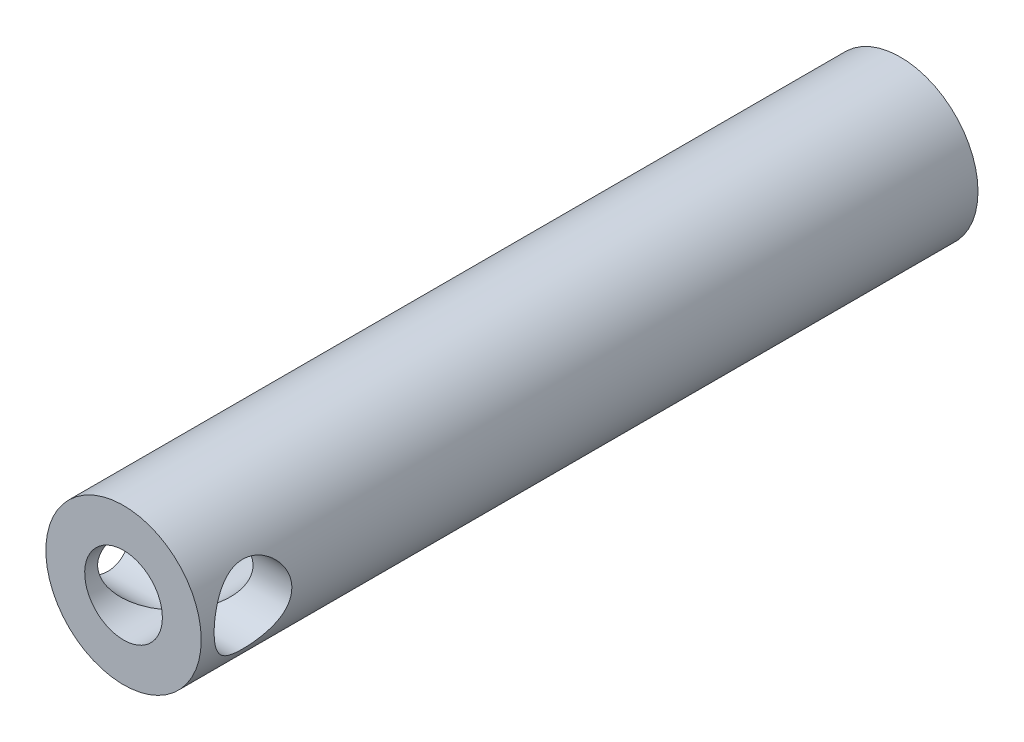
ISO-10303-21;
HEADER;
FILE_DESCRIPTION(('STEP AP214'),'2;1');
FILE_NAME('part.step','',(''),(''),'','','');
FILE_SCHEMA(('AUTOMOTIVE_DESIGN { 1 0 10303 214 1 1 1 1 }'));
ENDSEC;
DATA;
#1=APPLICATION_CONTEXT('core data for automotive mechanical design processes');
#2=APPLICATION_PROTOCOL_DEFINITION('international standard','automotive_design',2000,#1);
#3=PRODUCT_CONTEXT('',#1,'mechanical');
#4=PRODUCT('Part','Part','',(#3));
#5=PRODUCT_RELATED_PRODUCT_CATEGORY('part','',(#4));
#6=PRODUCT_DEFINITION_FORMATION('','',#4);
#7=PRODUCT_DEFINITION_CONTEXT('part definition',#1,'design');
#8=PRODUCT_DEFINITION('design','',#6,#7);
#9=PRODUCT_DEFINITION_SHAPE('','',#8);
#10=(LENGTH_UNIT() NAMED_UNIT(*) SI_UNIT(.MILLI.,.METRE.));
#11=(NAMED_UNIT(*) PLANE_ANGLE_UNIT() SI_UNIT($,.RADIAN.));
#12=(NAMED_UNIT(*) SI_UNIT($,.STERADIAN.) SOLID_ANGLE_UNIT());
#13=UNCERTAINTY_MEASURE_WITH_UNIT(LENGTH_MEASURE(1.E-05),#10,'distance_accuracy_value','');
#14=(GEOMETRIC_REPRESENTATION_CONTEXT(3) GLOBAL_UNCERTAINTY_ASSIGNED_CONTEXT((#13)) GLOBAL_UNIT_ASSIGNED_CONTEXT((#10,
#11,#12)) REPRESENTATION_CONTEXT('',''));
#15=CARTESIAN_POINT('',(0.,0.,0.));
#16=DIRECTION('',(0.,0.,1.));
#17=DIRECTION('',(1.,0.,0.));
#18=AXIS2_PLACEMENT_3D('',#15,#16,#17);
#19=CARTESIAN_POINT('',(0.,0.,150.));
#20=DIRECTION('',(0.,0.,-1.));
#21=DIRECTION('',(-1.,0.,0.));
#22=AXIS2_PLACEMENT_3D('',#19,#20,#21);
#23=CYLINDRICAL_SURFACE('',#22,7.5);
#24=CARTESIAN_POINT('',(0.,0.,140.));
#25=DIRECTION('',(0.707106781186547,0.,-0.707106781186547));
#26=DIRECTION('',(-0.707106781186547,0.,-0.707106781186547));
#27=AXIS2_PLACEMENT_3D('',#24,#25,#26);
#28=ELLIPSE('',#27,10.6066017177982,7.50000000000001);
#29=CARTESIAN_POINT('',(0.,-7.50000000000001,140.));
#30=VERTEX_POINT('',#29);
#31=CARTESIAN_POINT('',(0.,7.50000000000001,140.));
#32=VERTEX_POINT('',#31);
#33=EDGE_CURVE('E11',#30,#32,#28,.F.);
#34=ORIENTED_EDGE('',*,*,#33,.F.);
#35=CARTESIAN_POINT('',(0.,0.,140.));
#36=DIRECTION('',(-0.707106781186547,0.,-0.707106781186547));
#37=DIRECTION('',(0.707106781186547,0.,-0.707106781186547));
#38=AXIS2_PLACEMENT_3D('',#35,#36,#37);
#39=ELLIPSE('',#38,10.6066017177982,7.50000000000001);
#40=EDGE_CURVE('E55',#32,#30,#39,.F.);
#41=ORIENTED_EDGE('',*,*,#40,.F.);
#42=EDGE_LOOP('',(#34,#41));
#43=FACE_BOUND('',#42,.T.);
#44=CARTESIAN_POINT('',(0.,0.,150.));
#45=DIRECTION('',(0.,0.,1.));
#46=DIRECTION('',(1.,0.,0.));
#47=AXIS2_PLACEMENT_3D('',#44,#45,#46);
#48=CIRCLE('',#47,7.5);
#49=CARTESIAN_POINT('',(7.5,0.,150.));
#50=VERTEX_POINT('',#49);
#51=EDGE_CURVE('E82',#50,#50,#48,.T.);
#52=ORIENTED_EDGE('',*,*,#51,.T.);
#53=EDGE_LOOP('',(#52));
#54=FACE_BOUND('',#53,.T.);
#55=ADVANCED_FACE('F39',(#43,#54),#23,.F.);
#56=CARTESIAN_POINT('',(0.,0.,150.));
#57=DIRECTION('',(0.,0.,1.));
#58=DIRECTION('',(1.,0.,0.));
#59=AXIS2_PLACEMENT_3D('',#56,#57,#58);
#60=PLANE('',#59);
#61=CARTESIAN_POINT('',(0.,0.,150.));
#62=DIRECTION('',(0.,0.,1.));
#63=DIRECTION('',(1.,0.,0.));
#64=AXIS2_PLACEMENT_3D('',#61,#62,#63);
#65=CIRCLE('',#64,15.);
#66=CARTESIAN_POINT('',(15.,0.,150.));
#67=VERTEX_POINT('',#66);
#68=EDGE_CURVE('E71',#67,#67,#65,.T.);
#69=ORIENTED_EDGE('',*,*,#68,.T.);
#70=EDGE_LOOP('',(#69));
#71=FACE_BOUND('',#70,.T.);
#72=ORIENTED_EDGE('',*,*,#51,.F.);
#73=EDGE_LOOP('',(#72));
#74=FACE_BOUND('',#73,.T.);
#75=ADVANCED_FACE('F109',(#71,#74),#60,.T.);
#76=CARTESIAN_POINT('',(0.,0.,0.));
#77=DIRECTION('',(0.,0.,1.));
#78=DIRECTION('',(1.,0.,0.));
#79=AXIS2_PLACEMENT_3D('',#76,#77,#78);
#80=PLANE('',#79);
#81=CARTESIAN_POINT('',(0.,0.,0.));
#82=DIRECTION('',(0.,0.,1.));
#83=DIRECTION('',(1.,0.,0.));
#84=AXIS2_PLACEMENT_3D('',#81,#82,#83);
#85=CIRCLE('',#84,15.);
#86=CARTESIAN_POINT('',(15.,0.,0.));
#87=VERTEX_POINT('',#86);
#88=EDGE_CURVE('E78',#87,#87,#85,.T.);
#89=ORIENTED_EDGE('',*,*,#88,.F.);
#90=EDGE_LOOP('',(#89));
#91=FACE_BOUND('',#90,.T.);
#92=CARTESIAN_POINT('',(0.,0.,0.));
#93=DIRECTION('',(0.,0.,1.));
#94=DIRECTION('',(1.,0.,0.));
#95=AXIS2_PLACEMENT_3D('',#92,#93,#94);
#96=CIRCLE('',#95,7.5);
#97=CARTESIAN_POINT('',(7.5,0.,0.));
#98=VERTEX_POINT('',#97);
#99=EDGE_CURVE('E86',#98,#98,#96,.T.);
#100=ORIENTED_EDGE('',*,*,#99,.T.);
#101=EDGE_LOOP('',(#100));
#102=FACE_BOUND('',#101,.T.);
#103=ADVANCED_FACE('F111',(#91,#102),#80,.F.);
#104=CARTESIAN_POINT('',(0.,0.,150.));
#105=DIRECTION('',(0.,0.,-1.));
#106=DIRECTION('',(-1.,0.,0.));
#107=AXIS2_PLACEMENT_3D('',#104,#105,#106);
#108=CYLINDRICAL_SURFACE('',#107,15.);
#109=CARTESIAN_POINT('',(-15.,0.,132.5));
#110=CARTESIAN_POINT('',(-14.999999396748,0.197233319634611,132.500000658346));
#111=CARTESIAN_POINT('',(-14.9961007967494,0.394480447697187,132.507789162243));
#112=CARTESIAN_POINT('',(-14.9806046675974,0.78752188715394,132.538854341853));
#113=CARTESIAN_POINT('',(-14.9690037891684,0.983315529042053,132.562137755418));
#114=CARTESIAN_POINT('',(-14.9383810125726,1.37217475867236,132.623961151431));
#115=CARTESIAN_POINT('',(-14.9193485331296,1.56523604806031,132.662522888645));
#116=CARTESIAN_POINT('',(-14.8743407347001,1.94703954292032,132.754476042113));
#117=CARTESIAN_POINT('',(-14.8483625753491,2.13577994705356,132.807873525644));
#118=CARTESIAN_POINT('',(-14.7902312659494,2.50682232648196,132.928668095863));
#119=CARTESIAN_POINT('',(-14.7581053582234,2.68914865467159,132.996003523464));
#120=CARTESIAN_POINT('',(-14.6883654003789,3.04717071465553,133.144175405478));
#121=CARTESIAN_POINT('',(-14.6507493870819,3.2228640461852,133.225016690883));
#122=CARTESIAN_POINT('',(-14.5309652318162,3.73833299838092,133.486694195569));
#123=CARTESIAN_POINT('',(-14.4417945935421,4.06690309396203,133.686817510009));
#124=CARTESIAN_POINT('',(-14.2466964933283,4.70640207469269,134.14643830497));
#125=CARTESIAN_POINT('',(-14.1400816438171,5.01506114711125,134.408795342037));
#126=CARTESIAN_POINT('',(-13.9784212341451,5.4430823188078,134.836314997648));
#127=CARTESIAN_POINT('',(-13.9242051894336,5.58001386248579,134.984604271373));
#128=CARTESIAN_POINT('',(-13.8164776143495,5.84165491097174,135.291945599091));
#129=CARTESIAN_POINT('',(-13.7629662024985,5.96636238182053,135.450999436778));
#130=CARTESIAN_POINT('',(-13.6539394008806,6.21203614609388,135.791897236252));
#131=CARTESIAN_POINT('',(-13.5985925588041,6.33195448776318,135.974551367298));
#132=CARTESIAN_POINT('',(-13.492094780061,6.55581721686291,136.350467166656));
#133=CARTESIAN_POINT('',(-13.4409420901998,6.659768294792,136.543724345824));
#134=CARTESIAN_POINT('',(-13.3445910586524,6.85079105860992,136.939774601529));
#135=CARTESIAN_POINT('',(-13.2993909012603,6.93786789550112,137.142564744488));
#136=CARTESIAN_POINT('',(-13.2166574842323,7.09420885808464,137.556414411834));
#137=CARTESIAN_POINT('',(-13.1791233751457,7.16347495754888,137.767473016927));
#138=CARTESIAN_POINT('',(-13.1152671777941,7.27969095551672,138.18343629313));
#139=CARTESIAN_POINT('',(-13.088409003038,7.32772731202128,138.38795469478));
#140=CARTESIAN_POINT('',(-13.0439533148363,7.40657415403487,138.801287345446));
#141=CARTESIAN_POINT('',(-13.0263554052528,7.43738537640828,139.010101410305));
#142=CARTESIAN_POINT('',(-13.0011924893624,7.48128583073155,139.430010951103));
#143=CARTESIAN_POINT('',(-12.993618996979,7.49439005257305,139.641104344664));
#144=CARTESIAN_POINT('',(-12.9888194928446,7.50270600478309,140.063751879231));
#145=CARTESIAN_POINT('',(-12.9915924938538,7.49791944225106,140.275305974353));
#146=CARTESIAN_POINT('',(-13.0064057924061,7.47218723712112,140.671553641131));
#147=CARTESIAN_POINT('',(-13.0172945533465,7.45324879131871,140.856425228133));
#148=CARTESIAN_POINT('',(-13.0466085215773,7.40181622089093,141.223729449874));
#149=CARTESIAN_POINT('',(-13.065036219764,7.36931761586151,141.406161257906));
#150=CARTESIAN_POINT('',(-13.1088213055836,7.29114561844777,141.767293918201));
#151=CARTESIAN_POINT('',(-13.1341777592319,7.24547400171692,141.945995269831));
#152=CARTESIAN_POINT('',(-13.1910489784068,7.14141020631307,142.298714707848));
#153=CARTESIAN_POINT('',(-13.222566201213,7.08301295083102,142.4727308939));
#154=CARTESIAN_POINT('',(-13.2916331750086,6.95255736213901,142.819034719695));
#155=CARTESIAN_POINT('',(-13.3293043213991,6.88021734471419,142.991191987558));
#156=CARTESIAN_POINT('',(-13.4091058014596,6.72336395223288,143.328821929585));
#157=CARTESIAN_POINT('',(-13.4512376153395,6.63884653289771,143.49429235949));
#158=CARTESIAN_POINT('',(-13.5827161365204,6.36789880537373,143.979583774749));
#159=CARTESIAN_POINT('',(-13.6771793137099,6.16401254035424,144.288444067265));
#160=CARTESIAN_POINT('',(-13.8835116827651,5.68542700201845,144.908998919294));
#161=CARTESIAN_POINT('',(-13.9960691755619,5.40502682962124,145.216087163372));
#162=CARTESIAN_POINT('',(-14.1610583156088,4.94881247274572,145.639362818518));
#163=CARTESIAN_POINT('',(-14.2154461134507,4.79069598182256,145.774300805878));
#164=CARTESIAN_POINT('',(-14.3216433742747,4.46319636456161,146.031014794876));
#165=CARTESIAN_POINT('',(-14.3734524995837,4.29381176943411,146.152789075182));
#166=CARTESIAN_POINT('',(-14.4755004113358,3.93649737411748,146.387629881894));
#167=CARTESIAN_POINT('',(-14.5255523150677,3.74807068630639,146.500022432246));
#168=CARTESIAN_POINT('',(-14.6199518429338,3.36104932929114,146.708323892062));
#169=CARTESIAN_POINT('',(-14.6643020292947,3.162459283766,146.804240212143));
#170=CARTESIAN_POINT('',(-14.7460120172744,2.75644498721041,146.978595935126));
#171=CARTESIAN_POINT('',(-14.7833745338763,2.54902420588264,147.057042128126));
#172=CARTESIAN_POINT('',(-14.8499857401209,2.12686703288176,147.195538028708));
#173=CARTESIAN_POINT('',(-14.8792353631224,1.9121314859398,147.255589852579));
#174=CARTESIAN_POINT('',(-14.9266434935569,1.49520060410316,147.352299408973));
#175=CARTESIAN_POINT('',(-14.9455200325964,1.29343993576983,147.390482935823));
#176=CARTESIAN_POINT('',(-14.9751451894528,0.886879460889945,147.450211364968));
#177=CARTESIAN_POINT('',(-14.9858942493696,0.682079820268418,147.471757172284));
#178=CARTESIAN_POINT('',(-14.9989557072523,0.27121608969477,147.497919741893));
#179=CARTESIAN_POINT('',(-15.0012714784182,0.0651525383335625,147.502543272869));
#180=CARTESIAN_POINT('',(-14.9974085489777,-0.346571468999532,147.494816607655));
#181=CARTESIAN_POINT('',(-14.9912302243018,-0.552231942407382,147.482467162654));
#182=CARTESIAN_POINT('',(-14.9713647745727,-0.945483703972692,147.442582324293));
#183=CARTESIAN_POINT('',(-14.9582993834851,-1.133235693275,147.41630345572));
#184=CARTESIAN_POINT('',(-14.9254086100729,-1.5057028354874,147.349738784653));
#185=CARTESIAN_POINT('',(-14.9055809328309,-1.69041693509204,147.30944822692));
#186=CARTESIAN_POINT('',(-14.8596377637143,-2.05548161642883,147.21529769331));
#187=CARTESIAN_POINT('',(-14.8335242870997,-2.23583357633263,147.16144206621));
#188=CARTESIAN_POINT('',(-14.7755872196551,-2.59122720556854,147.04065229405));
#189=CARTESIAN_POINT('',(-14.743761406929,-2.76626677748716,146.973713059027));
#190=CARTESIAN_POINT('',(-14.6741281629767,-3.11487231777693,146.825280755148));
#191=CARTESIAN_POINT('',(-14.636177437618,-3.28825774429607,146.743430702641));
#192=CARTESIAN_POINT('',(-14.5558172256269,-3.62748137850216,146.567187329831));
#193=CARTESIAN_POINT('',(-14.5134062285665,-3.79331700210343,146.472789757557));
#194=CARTESIAN_POINT('',(-14.3808355856942,-4.27827609975167,146.171792385416));
#195=CARTESIAN_POINT('',(-14.2853004428519,-4.58503393852599,145.947309749466));
#196=CARTESIAN_POINT('',(-14.0780904901238,-5.18834638761033,145.4317245935));
#197=CARTESIAN_POINT('',(-13.9657520358616,-5.48094083116617,145.136244718332));
#198=CARTESIAN_POINT('',(-13.7999731666702,-5.88061884377912,144.659555011994));
#199=CARTESIAN_POINT('',(-13.7451298302383,-6.00738638095382,144.49494948214));
#200=CARTESIAN_POINT('',(-13.6378032341987,-6.24720364816648,144.155196366893));
#201=CARTESIAN_POINT('',(-13.5853203284304,-6.36025132582033,143.980047210104));
#202=CARTESIAN_POINT('',(-13.4817918944242,-6.57696128828773,143.611305393062));
#203=CARTESIAN_POINT('',(-13.430941525462,-6.6798962551633,143.417229790808));
#204=CARTESIAN_POINT('',(-13.3353302893677,-6.86878239405518,143.019641101376));
#205=CARTESIAN_POINT('',(-13.2905664901843,-6.95474175273572,142.816132622057));
#206=CARTESIAN_POINT('',(-13.2088558963579,-7.10870779446041,142.40108760257));
#207=CARTESIAN_POINT('',(-13.1719028316166,-7.17672888846674,142.189557663795));
#208=CARTESIAN_POINT('',(-13.1073420248173,-7.29397564807539,141.759962588474));
#209=CARTESIAN_POINT('',(-13.0797328358565,-7.34320422385771,141.541898469448));
#210=CARTESIAN_POINT('',(-13.0372695609292,-7.41830673858423,141.122356402463));
#211=CARTESIAN_POINT('',(-13.021445483554,-7.44596893476451,140.921295683995));
#212=CARTESIAN_POINT('',(-12.9991026119521,-7.48490769106325,140.517079505525));
#213=CARTESIAN_POINT('',(-12.9925831848914,-7.49618536553767,140.313924188929));
#214=CARTESIAN_POINT('',(-12.9891213170173,-7.50218225151115,139.907364823322));
#215=CARTESIAN_POINT('',(-12.9921753339361,-7.49690758753644,139.703960894139));
#216=CARTESIAN_POINT('',(-13.0077254939855,-7.46989424045202,139.298620917695));
#217=CARTESIAN_POINT('',(-13.0202212505754,-7.44815623134423,139.096684810682));
#218=CARTESIAN_POINT('',(-13.0525163509744,-7.39139793729183,138.71516426952));
#219=CARTESIAN_POINT('',(-13.0715029011715,-7.35784677050873,138.535289198849));
#220=CARTESIAN_POINT('',(-13.116176635625,-7.27791219467993,138.179203303691));
#221=CARTESIAN_POINT('',(-13.1418660444746,-7.23152452505279,138.002993716735));
#222=CARTESIAN_POINT('',(-13.1991699931078,-7.12639386444852,137.655326939916));
#223=CARTESIAN_POINT('',(-13.2307837414909,-7.06765252360368,137.483869118799));
#224=CARTESIAN_POINT('',(-13.2990730578631,-6.93829971844234,137.14646591945));
#225=CARTESIAN_POINT('',(-13.3357505854504,-6.86768365648884,136.980522706275));
#226=CARTESIAN_POINT('',(-13.4158088277434,-6.71002238040007,136.644052363886));
#227=CARTESIAN_POINT('',(-13.4594736551204,-6.62219479035094,136.473959543641));
#228=CARTESIAN_POINT('',(-13.5503300057645,-6.43424064207577,136.141631623809));
#229=CARTESIAN_POINT('',(-13.5975227237681,-6.33410990987669,135.979399217123));
#230=CARTESIAN_POINT('',(-13.6942686473789,-6.12213847211232,135.663455561578));
#231=CARTESIAN_POINT('',(-13.7438224714345,-6.01029468923606,135.509746568336));
#232=CARTESIAN_POINT('',(-13.8441367211459,-5.77548095727848,135.211487758867));
#233=CARTESIAN_POINT('',(-13.8948972293982,-5.65251024494259,135.066938572117));
#234=CARTESIAN_POINT('',(-14.0027054261897,-5.3803518850056,134.770557502329));
#235=CARTESIAN_POINT('',(-14.059765681286,-5.22979541793193,134.619983779199));
#236=CARTESIAN_POINT('',(-14.1724674726751,-4.9161895585828,134.331985226123));
#237=CARTESIAN_POINT('',(-14.2281094181856,-4.75314382541698,134.194556571262));
#238=CARTESIAN_POINT('',(-14.3365905676768,-4.41516652803153,133.933540241072));
#239=CARTESIAN_POINT('',(-14.3894269722129,-4.24022347499013,133.80996625859));
#240=CARTESIAN_POINT('',(-14.4908173199864,-3.87959731338856,133.57779720789));
#241=CARTESIAN_POINT('',(-14.5393732098486,-3.69391915105053,133.469195318098));
#242=CARTESIAN_POINT('',(-14.631264866461,-3.31135574476218,133.267090032961));
#243=CARTESIAN_POINT('',(-14.6745577030524,-3.1143954162459,133.173708931277));
#244=CARTESIAN_POINT('',(-14.7542266224256,-2.7119802278996,133.004086220269));
#245=CARTESIAN_POINT('',(-14.7906061018549,-2.5065296002185,132.927836190789));
#246=CARTESIAN_POINT('',(-14.8553158088887,-2.08904591147876,132.793484390269));
#247=CARTESIAN_POINT('',(-14.8836635799129,-1.87702833672875,132.735343036952));
#248=CARTESIAN_POINT('',(-14.9315196572219,-1.44785490772257,132.637792929578));
#249=CARTESIAN_POINT('',(-14.9510333627761,-1.23070227758585,132.598372732663));
#250=CARTESIAN_POINT('',(-14.9771457489839,-0.844562643439676,132.54578832332));
#251=CARTESIAN_POINT('',(-14.9857011054743,-0.676238758375203,132.528632401943));
#252=CARTESIAN_POINT('',(-14.9971285683414,-0.338613325294024,132.505737800143));
#253=CARTESIAN_POINT('',(-15.0000005178519,-0.169311750421738,132.499999434854));
#254=CARTESIAN_POINT('',(-15.,0.,132.5));
#255=B_SPLINE_CURVE_WITH_KNOTS('',3,(#109,#110,#111,#112,#113,#114,#115,#116,#117,#118,#119,
#120,#121,#122,#123,#124,#125,#126,#127,#128,#129,#130,#131,#132,#133,#134,#135,#136,#137,#138,
#139,#140,#141,#142,#143,#144,#145,#146,#147,#148,#149,#150,#151,#152,#153,#154,#155,#156,#157,
#158,#159,#160,#161,#162,#163,#164,#165,#166,#167,#168,#169,#170,#171,#172,#173,#174,#175,#176,
#177,#178,#179,#180,#181,#182,#183,#184,#185,#186,#187,#188,#189,#190,#191,#192,#193,#194,#195,
#196,#197,#198,#199,#200,#201,#202,#203,#204,#205,#206,#207,#208,#209,#210,#211,#212,#213,#214,
#215,#216,#217,#218,#219,#220,#221,#222,#223,#224,#225,#226,#227,#228,#229,#230,#231,#232,#233,
#234,#235,#236,#237,#238,#239,#240,#241,#242,#243,#244,#245,#246,#247,#248,#249,#250,#251,#252,
#253,#254),.UNSPECIFIED.,.T.,.F.,(4,2,2,2,2,2,2,2,2,2,2,2,2,2,2,2,2,2,2,2,2,2,2,2,2,2,2,2,2,2,2,
2,2,2,2,2,2,2,2,2,2,2,2,2,2,2,2,2,2,2,2,2,2,2,2,2,2,2,2,2,2,2,2,2,2,2,2,2,2,2,2,2,4),(0.,
0.591532941974833,1.18332327605672,1.77595930484632,2.36883805772764,2.95914801973939,
3.5496695871672,4.72943162533672,5.98056661136064,6.60703434534516,7.2336061407615,
7.90898079290037,8.58407167742326,9.2589561590937,9.93376581833204,10.568238808629,
11.2026846550832,11.8365930731243,12.4704410065579,13.028257193232,13.5862578337467,
14.1441832938005,14.7023317433305,15.273234855264,15.8443280107123,16.9859990925924,
18.2724305981167,18.9164473004746,19.5605481150864,20.2347844625213,20.9087167558919,
21.5823866537383,22.2559790161609,22.8737744253103,23.4915362266239,24.1090509045151,
24.7265382534066,25.2959739410995,25.8656030708237,26.4350498171613,27.0047185399872,
27.5904412613962,28.1763629747791,29.3476075788121,30.6338695709977,31.2779290064004,
31.9220846696312,32.5976781105397,33.2729449395212,33.9476676191321,34.6222857698159,
35.2321453015406,35.8419633531151,36.4515557926873,37.0611232771687,37.6123930023859,
38.1638459202211,38.7152252248816,39.2668185053849,39.8552593497836,40.4439003831459,
41.0326964570339,41.6215329502021,42.282105969062,42.9424861878421,43.6035134248763,
44.2642384827035,44.9300352143687,45.5955039784388,46.2595077713263,46.9231051837463,
47.4308830472038,47.93867492549),.UNSPECIFIED.);
#256=CARTESIAN_POINT('',(-15.,0.,132.5));
#257=VERTEX_POINT('',#256);
#258=EDGE_CURVE('E90',#257,#257,#255,.T.);
#259=ORIENTED_EDGE('',*,*,#258,.T.);
#260=EDGE_LOOP('',(#259));
#261=FACE_BOUND('',#260,.T.);
#262=CARTESIAN_POINT('',(15.,0.,132.5));
#263=CARTESIAN_POINT('',(14.999999396748,-0.197233319634611,132.500000658346));
#264=CARTESIAN_POINT('',(14.9961007967494,-0.394480447697187,132.507789162243));
#265=CARTESIAN_POINT('',(14.9806046675974,-0.78752188715394,132.538854341853));
#266=CARTESIAN_POINT('',(14.9690037891684,-0.983315529042053,132.562137755418));
#267=CARTESIAN_POINT('',(14.9383810125726,-1.37217475867236,132.623961151431));
#268=CARTESIAN_POINT('',(14.9193485331296,-1.56523604806031,132.662522888645));
#269=CARTESIAN_POINT('',(14.8743407347001,-1.94703954292032,132.754476042113));
#270=CARTESIAN_POINT('',(14.8483625753491,-2.13577994705356,132.807873525644));
#271=CARTESIAN_POINT('',(14.7902312659494,-2.50682232648196,132.928668095863));
#272=CARTESIAN_POINT('',(14.7581053582234,-2.68914865467159,132.996003523464));
#273=CARTESIAN_POINT('',(14.6883654003789,-3.04717071465553,133.144175405478));
#274=CARTESIAN_POINT('',(14.6507493870819,-3.2228640461852,133.225016690883));
#275=CARTESIAN_POINT('',(14.5309652318162,-3.73833299838092,133.486694195569));
#276=CARTESIAN_POINT('',(14.4417945935421,-4.06690309396203,133.686817510009));
#277=CARTESIAN_POINT('',(14.2466964933283,-4.70640207469269,134.14643830497));
#278=CARTESIAN_POINT('',(14.1400816438171,-5.01506114711125,134.408795342037));
#279=CARTESIAN_POINT('',(13.9784212341451,-5.4430823188078,134.836314997648));
#280=CARTESIAN_POINT('',(13.9242051894336,-5.58001386248579,134.984604271373));
#281=CARTESIAN_POINT('',(13.8164776143495,-5.84165491097174,135.291945599091));
#282=CARTESIAN_POINT('',(13.7629662024985,-5.96636238182053,135.450999436778));
#283=CARTESIAN_POINT('',(13.6539394008806,-6.21203614609388,135.791897236252));
#284=CARTESIAN_POINT('',(13.5985925588041,-6.33195448776318,135.974551367298));
#285=CARTESIAN_POINT('',(13.492094780061,-6.55581721686291,136.350467166656));
#286=CARTESIAN_POINT('',(13.4409420901998,-6.659768294792,136.543724345824));
#287=CARTESIAN_POINT('',(13.3445910586524,-6.85079105860992,136.939774601529));
#288=CARTESIAN_POINT('',(13.2993909012603,-6.93786789550112,137.142564744488));
#289=CARTESIAN_POINT('',(13.2166574842323,-7.09420885808464,137.556414411834));
#290=CARTESIAN_POINT('',(13.1791233751457,-7.16347495754888,137.767473016927));
#291=CARTESIAN_POINT('',(13.1152671777941,-7.27969095551672,138.18343629313));
#292=CARTESIAN_POINT('',(13.088409003038,-7.32772731202128,138.38795469478));
#293=CARTESIAN_POINT('',(13.0439533148363,-7.40657415403487,138.801287345446));
#294=CARTESIAN_POINT('',(13.0263554052528,-7.43738537640828,139.010101410305));
#295=CARTESIAN_POINT('',(13.0011924893624,-7.48128583073155,139.430010951103));
#296=CARTESIAN_POINT('',(12.993618996979,-7.49439005257305,139.641104344664));
#297=CARTESIAN_POINT('',(12.9888194928446,-7.50270600478309,140.063751879231));
#298=CARTESIAN_POINT('',(12.9915924938538,-7.49791944225106,140.275305974353));
#299=CARTESIAN_POINT('',(13.0064057924061,-7.47218723712112,140.671553641131));
#300=CARTESIAN_POINT('',(13.0172945533465,-7.45324879131871,140.856425228133));
#301=CARTESIAN_POINT('',(13.0466085215773,-7.40181622089093,141.223729449874));
#302=CARTESIAN_POINT('',(13.065036219764,-7.36931761586151,141.406161257906));
#303=CARTESIAN_POINT('',(13.1088213055836,-7.29114561844777,141.767293918201));
#304=CARTESIAN_POINT('',(13.1341777592319,-7.24547400171692,141.945995269831));
#305=CARTESIAN_POINT('',(13.1910489784068,-7.14141020631307,142.298714707848));
#306=CARTESIAN_POINT('',(13.222566201213,-7.08301295083102,142.4727308939));
#307=CARTESIAN_POINT('',(13.2916331750086,-6.95255736213901,142.819034719695));
#308=CARTESIAN_POINT('',(13.3293043213991,-6.88021734471419,142.991191987558));
#309=CARTESIAN_POINT('',(13.4091058014596,-6.72336395223288,143.328821929585));
#310=CARTESIAN_POINT('',(13.4512376153395,-6.63884653289771,143.49429235949));
#311=CARTESIAN_POINT('',(13.5827161365204,-6.36789880537373,143.979583774749));
#312=CARTESIAN_POINT('',(13.6771793137099,-6.16401254035424,144.288444067265));
#313=CARTESIAN_POINT('',(13.8835116827651,-5.68542700201845,144.908998919294));
#314=CARTESIAN_POINT('',(13.9960691755619,-5.40502682962124,145.216087163372));
#315=CARTESIAN_POINT('',(14.1610583156088,-4.94881247274572,145.639362818518));
#316=CARTESIAN_POINT('',(14.2154461134507,-4.79069598182256,145.774300805878));
#317=CARTESIAN_POINT('',(14.3216433742747,-4.46319636456161,146.031014794876));
#318=CARTESIAN_POINT('',(14.3734524995837,-4.29381176943411,146.152789075182));
#319=CARTESIAN_POINT('',(14.4755004113358,-3.93649737411748,146.387629881894));
#320=CARTESIAN_POINT('',(14.5255523150677,-3.74807068630639,146.500022432246));
#321=CARTESIAN_POINT('',(14.6199518429338,-3.36104932929114,146.708323892062));
#322=CARTESIAN_POINT('',(14.6643020292947,-3.162459283766,146.804240212143));
#323=CARTESIAN_POINT('',(14.7460120172744,-2.75644498721041,146.978595935126));
#324=CARTESIAN_POINT('',(14.7833745338763,-2.54902420588264,147.057042128126));
#325=CARTESIAN_POINT('',(14.8499857401209,-2.12686703288176,147.195538028708));
#326=CARTESIAN_POINT('',(14.8792353631224,-1.9121314859398,147.255589852579));
#327=CARTESIAN_POINT('',(14.9266434935569,-1.49520060410316,147.352299408973));
#328=CARTESIAN_POINT('',(14.9455200325964,-1.29343993576983,147.390482935823));
#329=CARTESIAN_POINT('',(14.9751451894528,-0.886879460889945,147.450211364968));
#330=CARTESIAN_POINT('',(14.9858942493696,-0.682079820268418,147.471757172284));
#331=CARTESIAN_POINT('',(14.9989557072523,-0.27121608969477,147.497919741893));
#332=CARTESIAN_POINT('',(15.0012714784182,-0.0651525383335625,147.502543272869));
#333=CARTESIAN_POINT('',(14.9974085489777,0.346571468999532,147.494816607655));
#334=CARTESIAN_POINT('',(14.9912302243018,0.552231942407382,147.482467162654));
#335=CARTESIAN_POINT('',(14.9713647745727,0.945483703972692,147.442582324293));
#336=CARTESIAN_POINT('',(14.9582993834851,1.133235693275,147.41630345572));
#337=CARTESIAN_POINT('',(14.9254086100729,1.5057028354874,147.349738784653));
#338=CARTESIAN_POINT('',(14.9055809328309,1.69041693509204,147.30944822692));
#339=CARTESIAN_POINT('',(14.8596377637143,2.05548161642883,147.21529769331));
#340=CARTESIAN_POINT('',(14.8335242870997,2.23583357633263,147.16144206621));
#341=CARTESIAN_POINT('',(14.7755872196551,2.59122720556854,147.04065229405));
#342=CARTESIAN_POINT('',(14.743761406929,2.76626677748716,146.973713059027));
#343=CARTESIAN_POINT('',(14.6741281629767,3.11487231777693,146.825280755148));
#344=CARTESIAN_POINT('',(14.636177437618,3.28825774429607,146.743430702641));
#345=CARTESIAN_POINT('',(14.5558172256269,3.62748137850216,146.567187329831));
#346=CARTESIAN_POINT('',(14.5134062285665,3.79331700210343,146.472789757557));
#347=CARTESIAN_POINT('',(14.3808355856942,4.27827609975167,146.171792385416));
#348=CARTESIAN_POINT('',(14.2853004428519,4.58503393852599,145.947309749466));
#349=CARTESIAN_POINT('',(14.0780904901238,5.18834638761033,145.4317245935));
#350=CARTESIAN_POINT('',(13.9657520358616,5.48094083116617,145.136244718332));
#351=CARTESIAN_POINT('',(13.7999731666702,5.88061884377912,144.659555011994));
#352=CARTESIAN_POINT('',(13.7451298302383,6.00738638095382,144.49494948214));
#353=CARTESIAN_POINT('',(13.6378032341987,6.24720364816648,144.155196366893));
#354=CARTESIAN_POINT('',(13.5853203284304,6.36025132582033,143.980047210104));
#355=CARTESIAN_POINT('',(13.4817918944242,6.57696128828773,143.611305393062));
#356=CARTESIAN_POINT('',(13.430941525462,6.6798962551633,143.417229790808));
#357=CARTESIAN_POINT('',(13.3353302893677,6.86878239405518,143.019641101376));
#358=CARTESIAN_POINT('',(13.2905664901843,6.95474175273572,142.816132622057));
#359=CARTESIAN_POINT('',(13.2088558963579,7.10870779446041,142.40108760257));
#360=CARTESIAN_POINT('',(13.1719028316166,7.17672888846674,142.189557663795));
#361=CARTESIAN_POINT('',(13.1073420248173,7.29397564807539,141.759962588474));
#362=CARTESIAN_POINT('',(13.0797328358565,7.34320422385771,141.541898469448));
#363=CARTESIAN_POINT('',(13.0372695609292,7.41830673858423,141.122356402463));
#364=CARTESIAN_POINT('',(13.021445483554,7.44596893476451,140.921295683995));
#365=CARTESIAN_POINT('',(12.9991026119521,7.48490769106325,140.517079505525));
#366=CARTESIAN_POINT('',(12.9925831848914,7.49618536553767,140.313924188929));
#367=CARTESIAN_POINT('',(12.9891213170173,7.50218225151115,139.907364823322));
#368=CARTESIAN_POINT('',(12.9921753339361,7.49690758753644,139.703960894139));
#369=CARTESIAN_POINT('',(13.0077254939855,7.46989424045202,139.298620917695));
#370=CARTESIAN_POINT('',(13.0202212505754,7.44815623134423,139.096684810682));
#371=CARTESIAN_POINT('',(13.0525163509744,7.39139793729183,138.71516426952));
#372=CARTESIAN_POINT('',(13.0715029011715,7.35784677050873,138.535289198849));
#373=CARTESIAN_POINT('',(13.116176635625,7.27791219467993,138.179203303691));
#374=CARTESIAN_POINT('',(13.1418660444746,7.23152452505279,138.002993716735));
#375=CARTESIAN_POINT('',(13.1991699931078,7.12639386444852,137.655326939916));
#376=CARTESIAN_POINT('',(13.2307837414909,7.06765252360368,137.483869118799));
#377=CARTESIAN_POINT('',(13.2990730578631,6.93829971844234,137.14646591945));
#378=CARTESIAN_POINT('',(13.3357505854504,6.86768365648884,136.980522706275));
#379=CARTESIAN_POINT('',(13.4158088277434,6.71002238040007,136.644052363886));
#380=CARTESIAN_POINT('',(13.4594736551204,6.62219479035094,136.473959543641));
#381=CARTESIAN_POINT('',(13.5503300057645,6.43424064207577,136.141631623809));
#382=CARTESIAN_POINT('',(13.5975227237681,6.33410990987669,135.979399217123));
#383=CARTESIAN_POINT('',(13.6942686473789,6.12213847211232,135.663455561578));
#384=CARTESIAN_POINT('',(13.7438224714345,6.01029468923606,135.509746568336));
#385=CARTESIAN_POINT('',(13.8441367211459,5.77548095727848,135.211487758867));
#386=CARTESIAN_POINT('',(13.8948972293982,5.65251024494259,135.066938572117));
#387=CARTESIAN_POINT('',(14.0027054261897,5.3803518850056,134.770557502329));
#388=CARTESIAN_POINT('',(14.059765681286,5.22979541793193,134.619983779199));
#389=CARTESIAN_POINT('',(14.1724674726751,4.9161895585828,134.331985226123));
#390=CARTESIAN_POINT('',(14.2281094181856,4.75314382541698,134.194556571262));
#391=CARTESIAN_POINT('',(14.3365905676768,4.41516652803153,133.933540241072));
#392=CARTESIAN_POINT('',(14.3894269722129,4.24022347499013,133.80996625859));
#393=CARTESIAN_POINT('',(14.4908173199864,3.87959731338856,133.57779720789));
#394=CARTESIAN_POINT('',(14.5393732098486,3.69391915105053,133.469195318098));
#395=CARTESIAN_POINT('',(14.631264866461,3.31135574476218,133.267090032961));
#396=CARTESIAN_POINT('',(14.6745577030524,3.1143954162459,133.173708931277));
#397=CARTESIAN_POINT('',(14.7542266224256,2.7119802278996,133.004086220269));
#398=CARTESIAN_POINT('',(14.7906061018549,2.5065296002185,132.927836190789));
#399=CARTESIAN_POINT('',(14.8553158088887,2.08904591147876,132.793484390269));
#400=CARTESIAN_POINT('',(14.8836635799129,1.87702833672875,132.735343036952));
#401=CARTESIAN_POINT('',(14.9315196572219,1.44785490772257,132.637792929578));
#402=CARTESIAN_POINT('',(14.9510333627761,1.23070227758585,132.598372732663));
#403=CARTESIAN_POINT('',(14.9771457489839,0.844562643439676,132.54578832332));
#404=CARTESIAN_POINT('',(14.9857011054743,0.676238758375203,132.528632401943));
#405=CARTESIAN_POINT('',(14.9971285683414,0.338613325294024,132.505737800143));
#406=CARTESIAN_POINT('',(15.0000005178519,0.169311750421738,132.499999434854));
#407=CARTESIAN_POINT('',(15.,0.,132.5));
#408=B_SPLINE_CURVE_WITH_KNOTS('',3,(#262,#263,#264,#265,#266,#267,#268,#269,#270,#271,#272,
#273,#274,#275,#276,#277,#278,#279,#280,#281,#282,#283,#284,#285,#286,#287,#288,#289,#290,#291,
#292,#293,#294,#295,#296,#297,#298,#299,#300,#301,#302,#303,#304,#305,#306,#307,#308,#309,#310,
#311,#312,#313,#314,#315,#316,#317,#318,#319,#320,#321,#322,#323,#324,#325,#326,#327,#328,#329,
#330,#331,#332,#333,#334,#335,#336,#337,#338,#339,#340,#341,#342,#343,#344,#345,#346,#347,#348,
#349,#350,#351,#352,#353,#354,#355,#356,#357,#358,#359,#360,#361,#362,#363,#364,#365,#366,#367,
#368,#369,#370,#371,#372,#373,#374,#375,#376,#377,#378,#379,#380,#381,#382,#383,#384,#385,#386,
#387,#388,#389,#390,#391,#392,#393,#394,#395,#396,#397,#398,#399,#400,#401,#402,#403,#404,#405,
#406,#407),.UNSPECIFIED.,.T.,.F.,(4,2,2,2,2,2,2,2,2,2,2,2,2,2,2,2,2,2,2,2,2,2,2,2,2,2,2,2,2,2,2,
2,2,2,2,2,2,2,2,2,2,2,2,2,2,2,2,2,2,2,2,2,2,2,2,2,2,2,2,2,2,2,2,2,2,2,2,2,2,2,2,2,4),(0.,
0.591532941974833,1.18332327605672,1.77595930484632,2.36883805772764,2.95914801973939,
3.5496695871672,4.72943162533672,5.98056661136064,6.60703434534516,7.2336061407615,
7.90898079290037,8.58407167742326,9.2589561590937,9.93376581833204,10.568238808629,
11.2026846550832,11.8365930731243,12.4704410065579,13.028257193232,13.5862578337467,
14.1441832938005,14.7023317433305,15.273234855264,15.8443280107123,16.9859990925924,
18.2724305981167,18.9164473004746,19.5605481150864,20.2347844625213,20.9087167558919,
21.5823866537383,22.2559790161609,22.8737744253103,23.4915362266239,24.1090509045151,
24.7265382534066,25.2959739410995,25.8656030708237,26.4350498171613,27.0047185399872,
27.5904412613962,28.1763629747791,29.3476075788121,30.6338695709977,31.2779290064004,
31.9220846696312,32.5976781105397,33.2729449395212,33.9476676191321,34.6222857698159,
35.2321453015406,35.8419633531151,36.4515557926873,37.0611232771687,37.6123930023859,
38.1638459202211,38.7152252248816,39.2668185053849,39.8552593497836,40.4439003831459,
41.0326964570339,41.6215329502021,42.282105969062,42.9424861878421,43.6035134248763,
44.2642384827035,44.9300352143687,45.5955039784388,46.2595077713263,46.9231051837463,
47.4308830472038,47.93867492549),.UNSPECIFIED.);
#409=CARTESIAN_POINT('',(15.,0.,132.5));
#410=VERTEX_POINT('',#409);
#411=EDGE_CURVE('E100',#410,#410,#408,.T.);
#412=ORIENTED_EDGE('',*,*,#411,.T.);
#413=EDGE_LOOP('',(#412));
#414=FACE_BOUND('',#413,.T.);
#415=ORIENTED_EDGE('',*,*,#68,.F.);
#416=EDGE_LOOP('',(#415));
#417=FACE_BOUND('',#416,.T.);
#418=ORIENTED_EDGE('',*,*,#88,.T.);
#419=EDGE_LOOP('',(#418));
#420=FACE_BOUND('',#419,.T.);
#421=ADVANCED_FACE('F41',(#261,#414,#417,#420),#108,.T.);
#422=CARTESIAN_POINT('',(0.,0.,140.));
#423=DIRECTION('',(0.707106781186547,0.,-0.707106781186547));
#424=DIRECTION('',(-0.707106781186547,0.,-0.707106781186547));
#425=AXIS2_PLACEMENT_3D('',#422,#423,#424);
#426=ELLIPSE('',#425,10.6066017177982,7.50000000000001);
#427=EDGE_CURVE('E49',#30,#32,#426,.T.);
#428=ORIENTED_EDGE('',*,*,#427,.F.);
#429=CARTESIAN_POINT('',(0.,0.,140.));
#430=DIRECTION('',(-0.707106781186547,0.,-0.707106781186547));
#431=DIRECTION('',(0.707106781186547,0.,-0.707106781186547));
#432=AXIS2_PLACEMENT_3D('',#429,#430,#431);
#433=ELLIPSE('',#432,10.6066017177982,7.50000000000001);
#434=EDGE_CURVE('E60',#32,#30,#433,.T.);
#435=ORIENTED_EDGE('',*,*,#434,.F.);
#436=EDGE_LOOP('',(#428,#435));
#437=FACE_BOUND('',#436,.T.);
#438=ORIENTED_EDGE('',*,*,#99,.F.);
#439=EDGE_LOOP('',(#438));
#440=FACE_BOUND('',#439,.T.);
#441=ADVANCED_FACE('F74',(#437,#440),#23,.F.);
#442=CARTESIAN_POINT('',(-15.,0.,140.));
#443=DIRECTION('',(1.,0.,0.));
#444=DIRECTION('',(0.,0.,-1.));
#445=AXIS2_PLACEMENT_3D('',#442,#443,#444);
#446=CYLINDRICAL_SURFACE('',#445,7.50000000000001);
#447=ORIENTED_EDGE('',*,*,#427,.T.);
#448=ORIENTED_EDGE('',*,*,#40,.T.);
#449=EDGE_LOOP('',(#447,#448));
#450=FACE_BOUND('',#449,.T.);
#451=ORIENTED_EDGE('',*,*,#258,.F.);
#452=EDGE_LOOP('',(#451));
#453=FACE_BOUND('',#452,.T.);
#454=ADVANCED_FACE('F68',(#450,#453),#446,.F.);
#455=ORIENTED_EDGE('',*,*,#33,.T.);
#456=ORIENTED_EDGE('',*,*,#434,.T.);
#457=EDGE_LOOP('',(#455,#456));
#458=FACE_BOUND('',#457,.T.);
#459=ORIENTED_EDGE('',*,*,#411,.F.);
#460=EDGE_LOOP('',(#459));
#461=FACE_BOUND('',#460,.T.);
#462=ADVANCED_FACE('F61',(#458,#461),#446,.F.);
#463=CLOSED_SHELL('',(#55,#75,#103,#421,#441,#454,#462));
#464=MANIFOLD_SOLID_BREP('B2',#463);
#465=ADVANCED_BREP_SHAPE_REPRESENTATION('',(#18,#464),#14);
#466=SHAPE_DEFINITION_REPRESENTATION(#9,#465);
ENDSEC;
END-ISO-10303-21;
